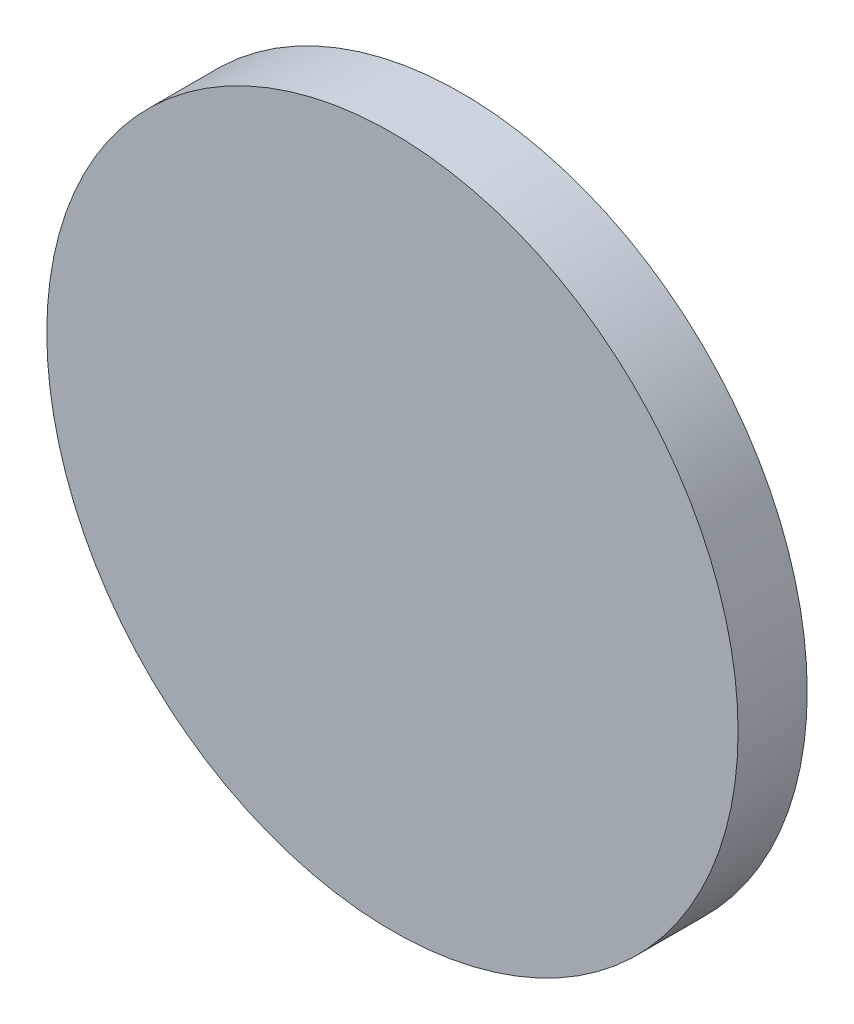
ISO-10303-21;
HEADER;
FILE_DESCRIPTION(('STEP AP214'),'2;1');
FILE_NAME('part.step','',(''),(''),'','','');
FILE_SCHEMA(('AUTOMOTIVE_DESIGN { 1 0 10303 214 1 1 1 1 }'));
ENDSEC;
DATA;
#1=APPLICATION_CONTEXT('core data for automotive mechanical design processes');
#2=APPLICATION_PROTOCOL_DEFINITION('international standard','automotive_design',2000,#1);
#3=PRODUCT_CONTEXT('',#1,'mechanical');
#4=PRODUCT('Part','Part','',(#3));
#5=PRODUCT_RELATED_PRODUCT_CATEGORY('part','',(#4));
#6=PRODUCT_DEFINITION_FORMATION('','',#4);
#7=PRODUCT_DEFINITION_CONTEXT('part definition',#1,'design');
#8=PRODUCT_DEFINITION('design','',#6,#7);
#9=PRODUCT_DEFINITION_SHAPE('','',#8);
#10=(LENGTH_UNIT() NAMED_UNIT(*) SI_UNIT(.MILLI.,.METRE.));
#11=(NAMED_UNIT(*) PLANE_ANGLE_UNIT() SI_UNIT($,.RADIAN.));
#12=(NAMED_UNIT(*) SI_UNIT($,.STERADIAN.) SOLID_ANGLE_UNIT());
#13=UNCERTAINTY_MEASURE_WITH_UNIT(LENGTH_MEASURE(1.E-05),#10,'distance_accuracy_value','');
#14=(GEOMETRIC_REPRESENTATION_CONTEXT(3) GLOBAL_UNCERTAINTY_ASSIGNED_CONTEXT((#13)) GLOBAL_UNIT_ASSIGNED_CONTEXT((#10,
#11,#12)) REPRESENTATION_CONTEXT('',''));
#15=CARTESIAN_POINT('',(0.,0.,0.));
#16=DIRECTION('',(0.,0.,1.));
#17=DIRECTION('',(1.,0.,0.));
#18=AXIS2_PLACEMENT_3D('',#15,#16,#17);
#19=CARTESIAN_POINT('',(-1685.22201946472,152.4,154.94));
#20=DIRECTION('',(0.,0.,-1.));
#21=DIRECTION('',(-1.,0.,0.));
#22=AXIS2_PLACEMENT_3D('',#19,#20,#21);
#23=CYLINDRICAL_SURFACE('',#22,12.7000000000002);
#24=CARTESIAN_POINT('',(-1685.22201946472,152.4,154.94));
#25=DIRECTION('',(0.,0.,1.));
#26=DIRECTION('',(-1.,0.,0.));
#27=AXIS2_PLACEMENT_3D('',#24,#25,#26);
#28=CIRCLE('',#27,12.7000000000002);
#29=CARTESIAN_POINT('',(-1697.92201946472,152.4,154.94));
#30=VERTEX_POINT('',#29);
#31=EDGE_CURVE('E10',#30,#30,#28,.T.);
#32=ORIENTED_EDGE('',*,*,#31,.F.);
#33=EDGE_LOOP('',(#32));
#34=FACE_BOUND('',#33,.T.);
#35=CARTESIAN_POINT('',(-1685.22201946472,152.4,152.4));
#36=DIRECTION('',(0.,0.,1.));
#37=DIRECTION('',(-1.,0.,0.));
#38=AXIS2_PLACEMENT_3D('',#35,#36,#37);
#39=CIRCLE('',#38,12.7000000000002);
#40=CARTESIAN_POINT('',(-1697.92201946472,152.4,152.4));
#41=VERTEX_POINT('',#40);
#42=EDGE_CURVE('E35',#41,#41,#39,.T.);
#43=ORIENTED_EDGE('',*,*,#42,.T.);
#44=EDGE_LOOP('',(#43));
#45=FACE_BOUND('',#44,.T.);
#46=ADVANCED_FACE('F32',(#34,#45),#23,.T.);
#47=CARTESIAN_POINT('',(-1685.22201946472,152.4,154.94));
#48=DIRECTION('',(0.,0.,1.));
#49=DIRECTION('',(1.,0.,0.));
#50=AXIS2_PLACEMENT_3D('',#47,#48,#49);
#51=PLANE('',#50);
#52=ORIENTED_EDGE('',*,*,#31,.T.);
#53=EDGE_LOOP('',(#52));
#54=FACE_BOUND('',#53,.T.);
#55=ADVANCED_FACE('F47',(#54),#51,.T.);
#56=CARTESIAN_POINT('',(-1685.22201946472,152.4,152.4));
#57=DIRECTION('',(0.,0.,1.));
#58=DIRECTION('',(1.,0.,0.));
#59=AXIS2_PLACEMENT_3D('',#56,#57,#58);
#60=PLANE('',#59);
#61=ORIENTED_EDGE('',*,*,#42,.F.);
#62=EDGE_LOOP('',(#61));
#63=FACE_BOUND('',#62,.T.);
#64=ADVANCED_FACE('F45',(#63),#60,.F.);
#65=CLOSED_SHELL('',(#46,#55,#64));
#66=MANIFOLD_SOLID_BREP('B2',#65);
#67=ADVANCED_BREP_SHAPE_REPRESENTATION('',(#18,#66),#14);
#68=SHAPE_DEFINITION_REPRESENTATION(#9,#67);
ENDSEC;
END-ISO-10303-21;
